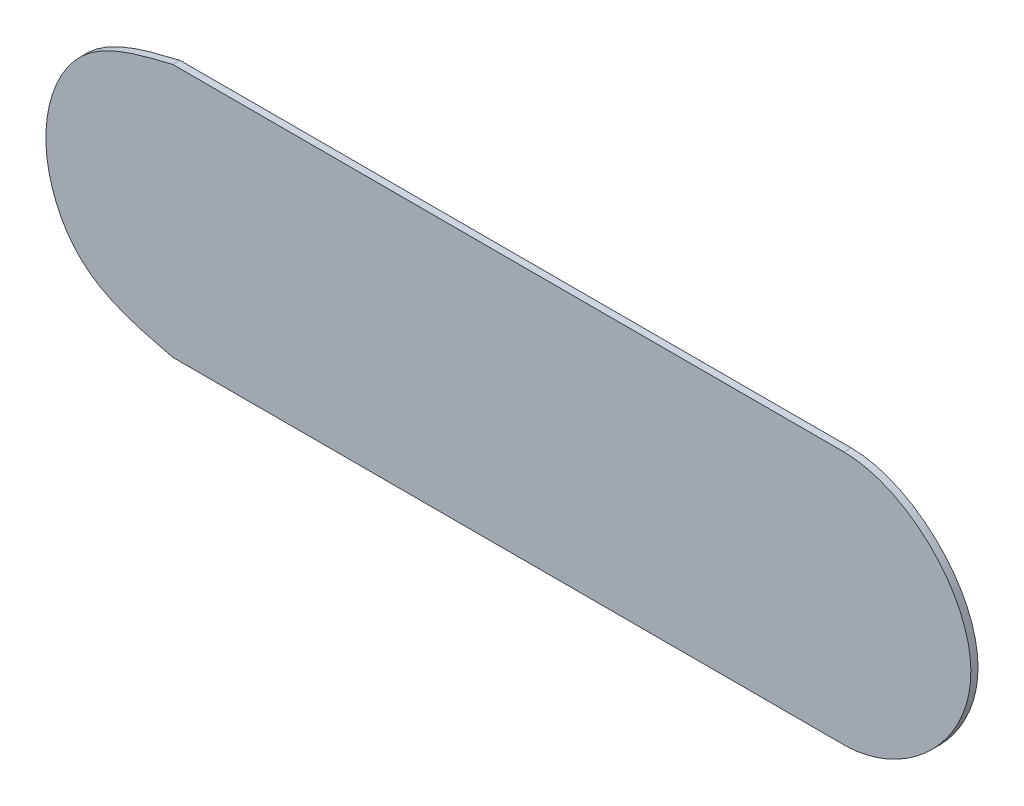
ISO-10303-21;
HEADER;
FILE_DESCRIPTION(('STEP AP214'),'2;1');
FILE_NAME('part.step','',(''),(''),'','','');
FILE_SCHEMA(('AUTOMOTIVE_DESIGN { 1 0 10303 214 1 1 1 1 }'));
ENDSEC;
DATA;
#1=APPLICATION_CONTEXT('core data for automotive mechanical design processes');
#2=APPLICATION_PROTOCOL_DEFINITION('international standard','automotive_design',2000,#1);
#3=PRODUCT_CONTEXT('',#1,'mechanical');
#4=PRODUCT('Part','Part','',(#3));
#5=PRODUCT_RELATED_PRODUCT_CATEGORY('part','',(#4));
#6=PRODUCT_DEFINITION_FORMATION('','',#4);
#7=PRODUCT_DEFINITION_CONTEXT('part definition',#1,'design');
#8=PRODUCT_DEFINITION('design','',#6,#7);
#9=PRODUCT_DEFINITION_SHAPE('','',#8);
#10=(LENGTH_UNIT() NAMED_UNIT(*) SI_UNIT(.MILLI.,.METRE.));
#11=(NAMED_UNIT(*) PLANE_ANGLE_UNIT() SI_UNIT($,.RADIAN.));
#12=(NAMED_UNIT(*) SI_UNIT($,.STERADIAN.) SOLID_ANGLE_UNIT());
#13=UNCERTAINTY_MEASURE_WITH_UNIT(LENGTH_MEASURE(1.E-05),#10,'distance_accuracy_value','');
#14=(GEOMETRIC_REPRESENTATION_CONTEXT(3) GLOBAL_UNCERTAINTY_ASSIGNED_CONTEXT((#13)) GLOBAL_UNIT_ASSIGNED_CONTEXT((#10,
#11,#12)) REPRESENTATION_CONTEXT('',''));
#15=CARTESIAN_POINT('',(0.,0.,0.));
#16=DIRECTION('',(0.,0.,1.));
#17=DIRECTION('',(1.,0.,0.));
#18=AXIS2_PLACEMENT_3D('',#15,#16,#17);
#19=CARTESIAN_POINT('',(-18.2385520335852,52.9956713736744,78.0152897661009));
#20=CARTESIAN_POINT('',(-22.1874117996002,53.9505787698527,78.0152897661009));
#21=CARTESIAN_POINT('',(-30.0811259440434,55.8594249853393,78.0152897661009));
#22=CARTESIAN_POINT('',(-34.9851825771522,68.1065145944572,78.0152897661009));
#23=CARTESIAN_POINT('',(-30.0867075780175,80.3609349111087,78.0152897661009));
#24=CARTESIAN_POINT('',(-22.1880487255558,82.271167951015,78.0152897661009));
#25=CARTESIAN_POINT('',(-18.2367002231195,83.2267727698236,78.0152897661009));
#26=B_SPLINE_CURVE_WITH_KNOTS('',3,(#19,#20,#21,#22,#23,#24,#25),.UNSPECIFIED.,.F.,.F.,(4,1,1,1,
4),(0.,0.250055953602913,0.499858271708,0.749801288293823,1.),.UNSPECIFIED.);
#27=DIRECTION('',(0.,0.,-1.));
#28=VECTOR('',#27,1.);
#29=SURFACE_OF_LINEAR_EXTRUSION('',#26,#28);
#30=CARTESIAN_POINT('',(-18.2367002231195,83.2267727698236,77.1628374675063));
#31=CARTESIAN_POINT('',(-22.1880487255558,82.271167951015,77.1628374675063));
#32=CARTESIAN_POINT('',(-30.0867075780175,80.3609349111087,77.1628374675063));
#33=CARTESIAN_POINT('',(-34.9851825771522,68.1065145944572,77.1628374675063));
#34=CARTESIAN_POINT('',(-30.0811259440434,55.8594249853393,77.1628374675063));
#35=CARTESIAN_POINT('',(-22.1874117996002,53.9505787698527,77.1628374675063));
#36=CARTESIAN_POINT('',(-18.2385520335852,52.9956713736744,77.1628374675063));
#37=B_SPLINE_CURVE_WITH_KNOTS('',3,(#30,#31,#32,#33,#34,#35,#36),.UNSPECIFIED.,.F.,.F.,(4,1,1,1,
4),(0.,0.250198711706177,0.500141728292,0.749944046397087,1.),.UNSPECIFIED.);
#38=CARTESIAN_POINT('',(-18.2385520335852,52.9956713736744,77.1628374675063));
#39=VERTEX_POINT('',#38);
#40=CARTESIAN_POINT('',(-18.2367002231195,83.2267727698236,77.1628374675063));
#41=VERTEX_POINT('',#40);
#42=EDGE_CURVE('E156',#39,#41,#37,.F.);
#43=ORIENTED_EDGE('',*,*,#42,.F.);
#44=CARTESIAN_POINT('',(-18.2385520335852,52.9956713736744,77.1628374675063));
#45=DIRECTION('',(0.,0.,1.));
#46=VECTOR('',#45,1.);
#47=LINE('',#44,#46);
#48=CARTESIAN_POINT('',(-18.2385520335852,52.9956713736744,78.0152897661009));
#49=VERTEX_POINT('',#48);
#50=EDGE_CURVE('E36',#49,#39,#47,.F.);
#51=ORIENTED_EDGE('',*,*,#50,.F.);
#52=CARTESIAN_POINT('',(-18.2385520335852,52.9956713736744,78.0152897661009));
#53=CARTESIAN_POINT('',(-22.1874117996002,53.9505787698527,78.0152897661009));
#54=CARTESIAN_POINT('',(-30.0811259440434,55.8594249853393,78.0152897661009));
#55=CARTESIAN_POINT('',(-34.9851825771522,68.1065145944572,78.0152897661009));
#56=CARTESIAN_POINT('',(-30.0867075780175,80.3609349111087,78.0152897661009));
#57=CARTESIAN_POINT('',(-22.1880487255558,82.271167951015,78.0152897661009));
#58=CARTESIAN_POINT('',(-18.2367002231195,83.2267727698236,78.0152897661009));
#59=B_SPLINE_CURVE_WITH_KNOTS('',3,(#52,#53,#54,#55,#56,#57,#58),.UNSPECIFIED.,.F.,.F.,(4,1,1,1,
4),(0.,0.250055953602913,0.499858271708,0.749801288293823,1.),.UNSPECIFIED.);
#60=CARTESIAN_POINT('',(-18.2367002231195,83.2267727698236,78.0152897661009));
#61=VERTEX_POINT('',#60);
#62=EDGE_CURVE('E83',#49,#61,#59,.T.);
#63=ORIENTED_EDGE('',*,*,#62,.T.);
#64=CARTESIAN_POINT('',(-18.2367002231195,83.2267727698236,78.0152897661009));
#65=DIRECTION('',(0.,0.,-1.));
#66=VECTOR('',#65,1.);
#67=LINE('',#64,#66);
#68=EDGE_CURVE('E10',#61,#41,#67,.T.);
#69=ORIENTED_EDGE('',*,*,#68,.T.);
#70=EDGE_LOOP('',(#43,#51,#63,#69));
#71=FACE_BOUND('',#70,.T.);
#72=ADVANCED_FACE('F16',(#71),#29,.T.);
#73=CARTESIAN_POINT('',(-18.2366725699098,83.2267728114754,78.0152897661009));
#74=DIRECTION('',(2.04961316342297E-09,1.,0.));
#75=DIRECTION('',(-1.,2.04961316342297E-09,0.));
#76=AXIS2_PLACEMENT_3D('',#73,#74,#75);
#77=PLANE('',#76);
#78=CARTESIAN_POINT('',(-18.2366725699098,83.2267728114754,77.1628374675063));
#79=CARTESIAN_POINT('',(8.42934981751324,83.2267727568204,77.1628374675063));
#80=CARTESIAN_POINT('',(35.0953722049363,83.2267727021654,77.1628374675063));
#81=CARTESIAN_POINT('',(61.7613945923593,83.2267726475104,77.1628374675063));
#82=B_SPLINE_CURVE_WITH_KNOTS('',3,(#78,#79,#80,#81),.UNSPECIFIED.,.F.,.F.,(4,4),(0.,1.),.UNSPECIFIED.);
#83=CARTESIAN_POINT('',(61.7615673621263,83.226773893559,77.1628374675063));
#84=VERTEX_POINT('',#83);
#85=EDGE_CURVE('E159',#41,#84,#82,.T.);
#86=ORIENTED_EDGE('',*,*,#85,.F.);
#87=ORIENTED_EDGE('',*,*,#68,.F.);
#88=CARTESIAN_POINT('',(-18.2366725699098,83.2267728114754,78.0152897661009));
#89=CARTESIAN_POINT('',(8.42934981751324,83.2267727568204,78.0152897661009));
#90=CARTESIAN_POINT('',(35.0953722049363,83.2267727021654,78.0152897661009));
#91=CARTESIAN_POINT('',(61.7613945923593,83.2267726475104,78.0152897661009));
#92=B_SPLINE_CURVE_WITH_KNOTS('',3,(#88,#89,#90,#91),.UNSPECIFIED.,.F.,.F.,(4,4),(0.,1.),.UNSPECIFIED.);
#93=CARTESIAN_POINT('',(61.7615673621263,83.226773893559,78.0152897661009));
#94=VERTEX_POINT('',#93);
#95=EDGE_CURVE('E79',#61,#94,#92,.T.);
#96=ORIENTED_EDGE('',*,*,#95,.T.);
#97=CARTESIAN_POINT('',(61.7615673355997,83.2267738936009,77.1628374675063));
#98=DIRECTION('',(0.,0.,1.));
#99=VECTOR('',#98,1.);
#100=LINE('',#97,#99);
#101=EDGE_CURVE('E28',#94,#84,#100,.F.);
#102=ORIENTED_EDGE('',*,*,#101,.T.);
#103=EDGE_LOOP('',(#86,#87,#96,#102));
#104=FACE_BOUND('',#103,.T.);
#105=ADVANCED_FACE('F80',(#104),#77,.T.);
#106=CARTESIAN_POINT('',(61.7582354099266,83.2267786641823,78.0152897661009));
#107=CARTESIAN_POINT('',(69.0879619195408,83.2173727551034,78.0152897661048));
#108=CARTESIAN_POINT('',(76.8749818668503,76.0223951801474,78.0152897661009));
#109=CARTESIAN_POINT('',(76.8747750966241,60.1974116550008,78.0152897661009));
#110=CARTESIAN_POINT('',(69.0863407990891,53.01224170597,78.0152897660988));
#111=CARTESIAN_POINT('',(61.7552601676888,52.9956507685182,78.0152897661009));
#112=B_SPLINE_CURVE_WITH_KNOTS('',3,(#106,#107,#108,#109,#110,#111),.UNSPECIFIED.,.F.,.F.,(4,2,
4),(0.,0.500115966796875,1.00033571884036),.UNSPECIFIED.);
#113=DIRECTION('',(0.,0.,-1.));
#114=VECTOR('',#113,1.);
#115=SURFACE_OF_LINEAR_EXTRUSION('',#112,#114);
#116=CARTESIAN_POINT('',(61.7582354099266,83.2267786641823,77.1628374675063));
#117=CARTESIAN_POINT('',(69.0879619195408,83.2173727551034,77.1628374675103));
#118=CARTESIAN_POINT('',(76.8749818668503,76.0223951801474,77.1628374675064));
#119=CARTESIAN_POINT('',(76.8747750966241,60.1974116550008,77.1628374675064));
#120=CARTESIAN_POINT('',(69.0863407990891,53.01224170597,77.1628374675042));
#121=CARTESIAN_POINT('',(61.7552601676888,52.9956507685182,77.1628374675063));
#122=B_SPLINE_CURVE_WITH_KNOTS('',3,(#116,#117,#118,#119,#120,#121),.UNSPECIFIED.,.F.,.F.,(4,2,
4),(0.,0.500115966796875,1.00033571884036),.UNSPECIFIED.);
#123=CARTESIAN_POINT('',(61.7616138202691,52.9956669417916,77.1628374675063));
#124=VERTEX_POINT('',#123);
#125=EDGE_CURVE('E74',#84,#124,#122,.T.);
#126=ORIENTED_EDGE('',*,*,#125,.F.);
#127=ORIENTED_EDGE('',*,*,#101,.F.);
#128=CARTESIAN_POINT('',(61.7616138202691,52.9956669417916,78.0152897661009));
#129=VERTEX_POINT('',#128);
#130=EDGE_CURVE('E71',#94,#129,#112,.T.);
#131=ORIENTED_EDGE('',*,*,#130,.T.);
#132=CARTESIAN_POINT('',(61.7616137899925,52.9956669417059,78.0152897661009));
#133=DIRECTION('',(0.,0.,-1.));
#134=VECTOR('',#133,1.);
#135=LINE('',#132,#134);
#136=EDGE_CURVE('E53',#129,#124,#135,.T.);
#137=ORIENTED_EDGE('',*,*,#136,.T.);
#138=EDGE_LOOP('',(#126,#127,#131,#137));
#139=FACE_BOUND('',#138,.T.);
#140=ADVANCED_FACE('F69',(#139),#115,.T.);
#141=CARTESIAN_POINT('',(61.7614376277819,52.9956713448008,78.0152897661009));
#142=DIRECTION('',(-1.99618125624835E-11,-1.,0.));
#143=DIRECTION('',(1.,-1.99618125624835E-11,0.));
#144=AXIS2_PLACEMENT_3D('',#141,#142,#143);
#145=PLANE('',#144);
#146=CARTESIAN_POINT('',(61.7614376277819,52.9956713448008,77.1628374675063));
#147=CARTESIAN_POINT('',(35.0947744073262,52.9956713453332,77.1628374675063));
#148=CARTESIAN_POINT('',(8.42811118687052,52.9956713458655,77.1628374675063));
#149=CARTESIAN_POINT('',(-18.2385520335852,52.9956713463978,77.1628374675063));
#150=B_SPLINE_CURVE_WITH_KNOTS('',3,(#146,#147,#148,#149),.UNSPECIFIED.,.F.,.F.,(4,4),(0.,1.),.UNSPECIFIED.);
#151=EDGE_CURVE('E161',#124,#39,#150,.T.);
#152=ORIENTED_EDGE('',*,*,#151,.F.);
#153=ORIENTED_EDGE('',*,*,#136,.F.);
#154=CARTESIAN_POINT('',(61.7614376277819,52.9956713448008,78.0152897661009));
#155=CARTESIAN_POINT('',(35.0947744073262,52.9956713453332,78.0152897661009));
#156=CARTESIAN_POINT('',(8.42811118687052,52.9956713458655,78.0152897661009));
#157=CARTESIAN_POINT('',(-18.2385520335852,52.9956713463978,78.0152897661009));
#158=B_SPLINE_CURVE_WITH_KNOTS('',3,(#154,#155,#156,#157),.UNSPECIFIED.,.F.,.F.,(4,4),(0.,1.),.UNSPECIFIED.);
#159=EDGE_CURVE('E86',#129,#49,#158,.T.);
#160=ORIENTED_EDGE('',*,*,#159,.T.);
#161=ORIENTED_EDGE('',*,*,#50,.T.);
#162=EDGE_LOOP('',(#152,#153,#160,#161));
#163=FACE_BOUND('',#162,.T.);
#164=ADVANCED_FACE('F106',(#163),#145,.T.);
#165=CARTESIAN_POINT('',(21.7183424939833,54.1112219927918,78.0152897661009));
#166=DIRECTION('',(0.,0.,-1.));
#167=DIRECTION('',(0.,1.,0.));
#168=AXIS2_PLACEMENT_3D('',#165,#166,#167);
#169=PLANE('',#168);
#170=ORIENTED_EDGE('',*,*,#62,.F.);
#171=ORIENTED_EDGE('',*,*,#159,.F.);
#172=ORIENTED_EDGE('',*,*,#130,.F.);
#173=ORIENTED_EDGE('',*,*,#95,.F.);
#174=EDGE_LOOP('',(#170,#171,#172,#173));
#175=FACE_BOUND('',#174,.T.);
#176=ADVANCED_FACE('F85',(#175),#169,.F.);
#177=CARTESIAN_POINT('',(21.7183424939833,54.1112219927918,77.1628374675063));
#178=DIRECTION('',(0.,0.,-1.));
#179=DIRECTION('',(0.,1.,0.));
#180=AXIS2_PLACEMENT_3D('',#177,#178,#179);
#181=PLANE('',#180);
#182=ORIENTED_EDGE('',*,*,#42,.T.);
#183=ORIENTED_EDGE('',*,*,#85,.T.);
#184=ORIENTED_EDGE('',*,*,#125,.T.);
#185=ORIENTED_EDGE('',*,*,#151,.T.);
#186=EDGE_LOOP('',(#182,#183,#184,#185));
#187=FACE_BOUND('',#186,.T.);
#188=ADVANCED_FACE('F203',(#187),#181,.T.);
#189=CLOSED_SHELL('',(#72,#105,#140,#164,#176,#188));
#190=MANIFOLD_SOLID_BREP('B1',#189);
#191=ADVANCED_BREP_SHAPE_REPRESENTATION('',(#18,#190),#14);
#192=SHAPE_DEFINITION_REPRESENTATION(#9,#191);
ENDSEC;
END-ISO-10303-21;
